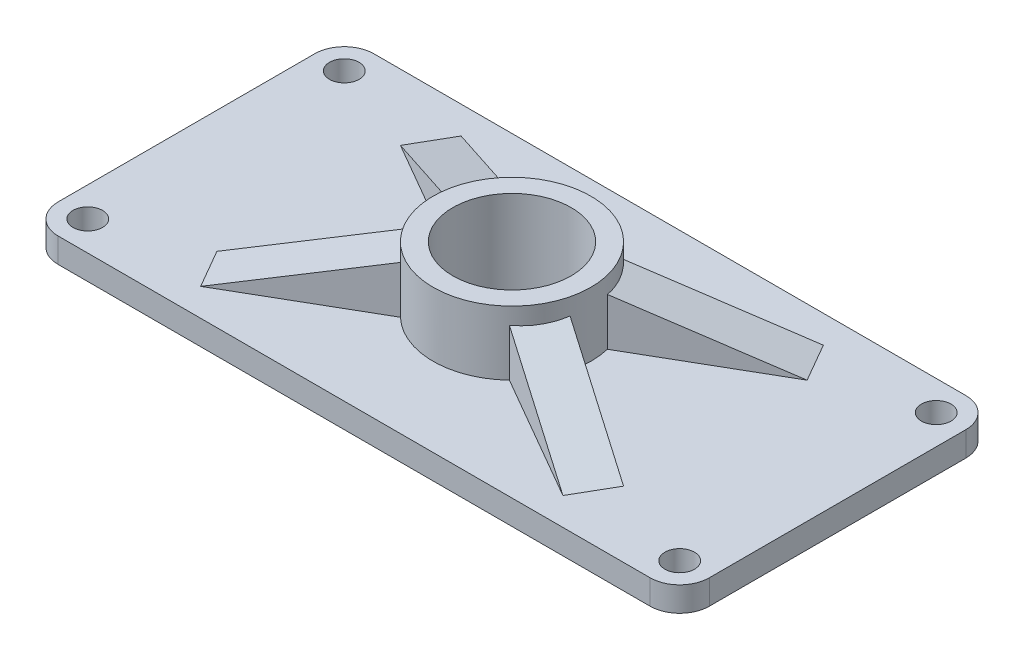
ISO-10303-21;
HEADER;
FILE_DESCRIPTION(('STEP AP214'),'2;1');
FILE_NAME('part.step','',(''),(''),'','','');
FILE_SCHEMA(('AUTOMOTIVE_DESIGN { 1 0 10303 214 1 1 1 1 }'));
ENDSEC;
DATA;
#1=APPLICATION_CONTEXT('core data for automotive mechanical design processes');
#2=APPLICATION_PROTOCOL_DEFINITION('international standard','automotive_design',2000,#1);
#3=PRODUCT_CONTEXT('',#1,'mechanical');
#4=PRODUCT('Part','Part','',(#3));
#5=PRODUCT_RELATED_PRODUCT_CATEGORY('part','',(#4));
#6=PRODUCT_DEFINITION_FORMATION('','',#4);
#7=PRODUCT_DEFINITION_CONTEXT('part definition',#1,'design');
#8=PRODUCT_DEFINITION('design','',#6,#7);
#9=PRODUCT_DEFINITION_SHAPE('','',#8);
#10=(LENGTH_UNIT() NAMED_UNIT(*) SI_UNIT(.MILLI.,.METRE.));
#11=(NAMED_UNIT(*) PLANE_ANGLE_UNIT() SI_UNIT($,.RADIAN.));
#12=(NAMED_UNIT(*) SI_UNIT($,.STERADIAN.) SOLID_ANGLE_UNIT());
#13=UNCERTAINTY_MEASURE_WITH_UNIT(LENGTH_MEASURE(1.E-05),#10,'distance_accuracy_value','');
#14=(GEOMETRIC_REPRESENTATION_CONTEXT(3) GLOBAL_UNCERTAINTY_ASSIGNED_CONTEXT((#13)) GLOBAL_UNIT_ASSIGNED_CONTEXT((#10,
#11,#12)) REPRESENTATION_CONTEXT('',''));
#15=CARTESIAN_POINT('',(0.,0.,0.));
#16=DIRECTION('',(0.,0.,1.));
#17=DIRECTION('',(1.,0.,0.));
#18=AXIS2_PLACEMENT_3D('',#15,#16,#17);
#19=CARTESIAN_POINT('',(-60.,5.,26.));
#20=DIRECTION('',(0.,-1.,0.));
#21=DIRECTION('',(0.,0.,-1.));
#22=AXIS2_PLACEMENT_3D('',#19,#20,#21);
#23=PLANE('',#22);
#24=CARTESIAN_POINT('',(-60.,5.,-26.));
#25=DIRECTION('',(0.,1.,0.));
#26=DIRECTION('',(0.,0.,1.));
#27=AXIS2_PLACEMENT_3D('',#24,#25,#26);
#28=CIRCLE('',#27,3.);
#29=CARTESIAN_POINT('',(-60.,5.,-23.));
#30=VERTEX_POINT('',#29);
#31=EDGE_CURVE('E309',#30,#30,#28,.T.);
#32=ORIENTED_EDGE('',*,*,#31,.F.);
#33=EDGE_LOOP('',(#32));
#34=FACE_BOUND('',#33,.T.);
#35=CARTESIAN_POINT('',(-60.,5.,-26.));
#36=DIRECTION('',(0.,1.,0.));
#37=DIRECTION('',(0.,0.,-1.));
#38=AXIS2_PLACEMENT_3D('',#35,#36,#37);
#39=CIRCLE('',#38,6.);
#40=CARTESIAN_POINT('',(-60.,5.,-32.));
#41=VERTEX_POINT('',#40);
#42=CARTESIAN_POINT('',(-66.,5.,-26.));
#43=VERTEX_POINT('',#42);
#44=EDGE_CURVE('E336',#41,#43,#39,.T.);
#45=ORIENTED_EDGE('',*,*,#44,.T.);
#46=DIRECTION('',(0.,0.,1.));
#47=VECTOR('',#46,1.);
#48=CARTESIAN_POINT('',(-66.,5.,26.));
#49=LINE('',#48,#47);
#50=CARTESIAN_POINT('',(-66.,5.,26.));
#51=VERTEX_POINT('',#50);
#52=EDGE_CURVE('E339',#43,#51,#49,.T.);
#53=ORIENTED_EDGE('',*,*,#52,.T.);
#54=CARTESIAN_POINT('',(-60.,5.,26.));
#55=DIRECTION('',(0.,1.,0.));
#56=DIRECTION('',(0.,0.,-1.));
#57=AXIS2_PLACEMENT_3D('',#54,#55,#56);
#58=CIRCLE('',#57,6.);
#59=CARTESIAN_POINT('',(-60.,5.,32.));
#60=VERTEX_POINT('',#59);
#61=EDGE_CURVE('E317',#51,#60,#58,.T.);
#62=ORIENTED_EDGE('',*,*,#61,.T.);
#63=DIRECTION('',(1.,0.,0.));
#64=VECTOR('',#63,1.);
#65=CARTESIAN_POINT('',(-60.,5.,32.));
#66=LINE('',#65,#64);
#67=CARTESIAN_POINT('',(60.,5.,32.));
#68=VERTEX_POINT('',#67);
#69=EDGE_CURVE('E320',#60,#68,#66,.T.);
#70=ORIENTED_EDGE('',*,*,#69,.T.);
#71=CARTESIAN_POINT('',(60.,5.,26.));
#72=DIRECTION('',(0.,1.,0.));
#73=DIRECTION('',(0.,0.,1.));
#74=AXIS2_PLACEMENT_3D('',#71,#72,#73);
#75=CIRCLE('',#74,6.);
#76=CARTESIAN_POINT('',(66.,5.,26.));
#77=VERTEX_POINT('',#76);
#78=EDGE_CURVE('E324',#68,#77,#75,.T.);
#79=ORIENTED_EDGE('',*,*,#78,.T.);
#80=DIRECTION('',(0.,0.,-1.));
#81=VECTOR('',#80,1.);
#82=CARTESIAN_POINT('',(66.,5.,26.));
#83=LINE('',#82,#81);
#84=CARTESIAN_POINT('',(66.,5.,-26.));
#85=VERTEX_POINT('',#84);
#86=EDGE_CURVE('E327',#77,#85,#83,.T.);
#87=ORIENTED_EDGE('',*,*,#86,.T.);
#88=CARTESIAN_POINT('',(60.,5.,-26.));
#89=DIRECTION('',(0.,1.,0.));
#90=DIRECTION('',(0.,0.,-1.));
#91=AXIS2_PLACEMENT_3D('',#88,#89,#90);
#92=CIRCLE('',#91,6.);
#93=CARTESIAN_POINT('',(60.,5.,-32.));
#94=VERTEX_POINT('',#93);
#95=EDGE_CURVE('E330',#85,#94,#92,.T.);
#96=ORIENTED_EDGE('',*,*,#95,.T.);
#97=DIRECTION('',(-1.,0.,0.));
#98=VECTOR('',#97,1.);
#99=CARTESIAN_POINT('',(-60.,5.,-32.));
#100=LINE('',#99,#98);
#101=EDGE_CURVE('E333',#94,#41,#100,.T.);
#102=ORIENTED_EDGE('',*,*,#101,.T.);
#103=EDGE_LOOP('',(#45,#53,#62,#70,#79,#87,#96,#102));
#104=FACE_BOUND('',#103,.T.);
#105=CARTESIAN_POINT('',(60.0000000000005,5.,26.));
#106=DIRECTION('',(0.,1.,0.));
#107=DIRECTION('',(0.,0.,1.));
#108=AXIS2_PLACEMENT_3D('',#105,#106,#107);
#109=CIRCLE('',#108,3.);
#110=CARTESIAN_POINT('',(60.0000000000005,5.,29.));
#111=VERTEX_POINT('',#110);
#112=EDGE_CURVE('E289',#111,#111,#109,.T.);
#113=ORIENTED_EDGE('',*,*,#112,.F.);
#114=EDGE_LOOP('',(#113));
#115=FACE_BOUND('',#114,.T.);
#116=CARTESIAN_POINT('',(60.,5.,-26.));
#117=DIRECTION('',(0.,1.,0.));
#118=DIRECTION('',(0.,0.,1.));
#119=AXIS2_PLACEMENT_3D('',#116,#117,#118);
#120=CIRCLE('',#119,3.);
#121=CARTESIAN_POINT('',(60.,5.,-23.));
#122=VERTEX_POINT('',#121);
#123=EDGE_CURVE('E297',#122,#122,#120,.T.);
#124=ORIENTED_EDGE('',*,*,#123,.F.);
#125=EDGE_LOOP('',(#124));
#126=FACE_BOUND('',#125,.T.);
#127=CARTESIAN_POINT('',(-59.9999999999995,5.,26.));
#128=DIRECTION('',(0.,1.,0.));
#129=DIRECTION('',(0.,0.,1.));
#130=AXIS2_PLACEMENT_3D('',#127,#128,#129);
#131=CIRCLE('',#130,3.);
#132=CARTESIAN_POINT('',(-59.9999999999995,5.,29.));
#133=VERTEX_POINT('',#132);
#134=EDGE_CURVE('E281',#133,#133,#131,.T.);
#135=ORIENTED_EDGE('',*,*,#134,.F.);
#136=EDGE_LOOP('',(#135));
#137=FACE_BOUND('',#136,.T.);
#138=DIRECTION('',(0.866025403784438,0.,0.500000000000001));
#139=VECTOR('',#138,1.);
#140=CARTESIAN_POINT('',(-35.9916697508022,5.,-15.5836477965032));
#141=LINE('',#140,#139);
#142=CARTESIAN_POINT('',(-41.2211431702997,5.,-18.6028856829701));
#143=VERTEX_POINT('',#142);
#144=CARTESIAN_POINT('',(-15.5470861469722,5.,-3.77996194936209));
#145=VERTEX_POINT('',#144);
#146=EDGE_CURVE('E216',#143,#145,#141,.T.);
#147=ORIENTED_EDGE('',*,*,#146,.F.);
#148=DIRECTION('',(0.500000000000001,0.,-0.866025403784438));
#149=VECTOR('',#148,1.);
#150=CARTESIAN_POINT('',(-65.2294734194975,5.,22.9807621135331));
#151=LINE('',#150,#149);
#152=CARTESIAN_POINT('',(-36.7211431702997,5.,-26.39711431703));
#153=VERTEX_POINT('',#152);
#154=EDGE_CURVE('E226',#143,#153,#151,.T.);
#155=ORIENTED_EDGE('',*,*,#154,.T.);
#156=DIRECTION('',(0.866025403784438,0.,0.500000000000001));
#157=VECTOR('',#156,1.);
#158=CARTESIAN_POINT('',(-31.4916697508022,5.,-23.3778764305631));
#159=LINE('',#158,#157);
#160=CARTESIAN_POINT('',(-11.0470861469722,5.,-11.574190583422));
#161=VERTEX_POINT('',#160);
#162=EDGE_CURVE('E223',#153,#161,#159,.T.);
#163=ORIENTED_EDGE('',*,*,#162,.T.);
#164=CARTESIAN_POINT('',(0.,5.,0.));
#165=DIRECTION('',(0.,-1.,0.));
#166=DIRECTION('',(0.,0.,-1.));
#167=AXIS2_PLACEMENT_3D('',#164,#165,#166);
#168=CIRCLE('',#167,16.);
#169=CARTESIAN_POINT('',(11.0470861469722,5.,-11.574190583422));
#170=VERTEX_POINT('',#169);
#171=EDGE_CURVE('E397',#170,#161,#168,.F.);
#172=ORIENTED_EDGE('',*,*,#171,.F.);
#173=DIRECTION('',(0.866025403784438,0.,-0.500000000000001));
#174=VECTOR('',#173,1.);
#175=CARTESIAN_POINT('',(-58.5083302491977,5.,28.5836477965033));
#176=LINE('',#175,#174);
#177=CARTESIAN_POINT('',(36.7211431702997,5.,-26.39711431703));
#178=VERTEX_POINT('',#177);
#179=EDGE_CURVE('E266',#170,#178,#176,.T.);
#180=ORIENTED_EDGE('',*,*,#179,.T.);
#181=DIRECTION('',(-0.500000000000001,0.,-0.866025403784438));
#182=VECTOR('',#181,1.);
#183=CARTESIAN_POINT('',(35.2294734194974,5.,-28.9807621135333));
#184=LINE('',#183,#182);
#185=CARTESIAN_POINT('',(41.2211431703,4.99999999999995,-18.6028856829702));
#186=VERTEX_POINT('',#185);
#187=EDGE_CURVE('E269',#178,#186,#184,.F.);
#188=ORIENTED_EDGE('',*,*,#187,.T.);
#189=DIRECTION('',(0.866025403784438,0.,-0.500000000000001));
#190=VECTOR('',#189,1.);
#191=CARTESIAN_POINT('',(-54.0083302491977,5.,36.3778764305632));
#192=LINE('',#191,#190);
#193=CARTESIAN_POINT('',(15.5470861469722,5.,-3.77996194936209));
#194=VERTEX_POINT('',#193);
#195=EDGE_CURVE('E259',#194,#186,#192,.T.);
#196=ORIENTED_EDGE('',*,*,#195,.F.);
#197=CARTESIAN_POINT('',(15.5470861469722,5.,3.77996194936209));
#198=VERTEX_POINT('',#197);
#199=EDGE_CURVE('E396',#198,#194,#168,.F.);
#200=ORIENTED_EDGE('',*,*,#199,.F.);
#201=DIRECTION('',(-0.866025403784438,0.,-0.500000000000001));
#202=VECTOR('',#201,1.);
#203=CARTESIAN_POINT('',(-31.4916697508022,5.,-23.3778764305631));
#204=LINE('',#203,#202);
#205=CARTESIAN_POINT('',(41.2211431702998,4.99999999999998,18.6028856829702));
#206=VERTEX_POINT('',#205);
#207=EDGE_CURVE('E64',#206,#198,#204,.T.);
#208=ORIENTED_EDGE('',*,*,#207,.F.);
#209=DIRECTION('',(-0.500000000000001,0.,0.866025403784438));
#210=VECTOR('',#209,1.);
#211=CARTESIAN_POINT('',(12.7128129211019,5.,67.9807621135332));
#212=LINE('',#211,#210);
#213=CARTESIAN_POINT('',(36.7211431702997,5.,26.39711431703));
#214=VERTEX_POINT('',#213);
#215=EDGE_CURVE('E59',#206,#214,#212,.T.);
#216=ORIENTED_EDGE('',*,*,#215,.T.);
#217=DIRECTION('',(-0.866025403784438,0.,-0.500000000000001));
#218=VECTOR('',#217,1.);
#219=CARTESIAN_POINT('',(-35.9916697508022,5.,-15.5836477965032));
#220=LINE('',#219,#218);
#221=CARTESIAN_POINT('',(11.0470861469722,5.,11.574190583422));
#222=VERTEX_POINT('',#221);
#223=EDGE_CURVE('E194',#214,#222,#220,.T.);
#224=ORIENTED_EDGE('',*,*,#223,.T.);
#225=CARTESIAN_POINT('',(-11.0470861469722,5.,11.574190583422));
#226=VERTEX_POINT('',#225);
#227=EDGE_CURVE('E403',#226,#222,#168,.F.);
#228=ORIENTED_EDGE('',*,*,#227,.F.);
#229=DIRECTION('',(-0.866025403784438,0.,0.500000000000001));
#230=VECTOR('',#229,1.);
#231=CARTESIAN_POINT('',(-54.0083302491977,5.,36.3778764305632));
#232=LINE('',#231,#230);
#233=CARTESIAN_POINT('',(-36.7211431702997,5.,26.39711431703));
#234=VERTEX_POINT('',#233);
#235=EDGE_CURVE('E238',#226,#234,#232,.T.);
#236=ORIENTED_EDGE('',*,*,#235,.T.);
#237=DIRECTION('',(0.500000000000001,0.,0.866025403784438));
#238=VECTOR('',#237,1.);
#239=CARTESIAN_POINT('',(-42.7128129211021,5.,16.0192378864668));
#240=LINE('',#239,#238);
#241=CARTESIAN_POINT('',(-41.2211431702997,5.00000000000001,18.6028856829701));
#242=VERTEX_POINT('',#241);
#243=EDGE_CURVE('E248',#234,#242,#240,.F.);
#244=ORIENTED_EDGE('',*,*,#243,.T.);
#245=DIRECTION('',(-0.866025403784438,0.,0.500000000000001));
#246=VECTOR('',#245,1.);
#247=CARTESIAN_POINT('',(-58.5083302491977,5.,28.5836477965033));
#248=LINE('',#247,#246);
#249=CARTESIAN_POINT('',(-15.5470861469722,5.,3.77996194936209));
#250=VERTEX_POINT('',#249);
#251=EDGE_CURVE('E244',#250,#242,#248,.T.);
#252=ORIENTED_EDGE('',*,*,#251,.F.);
#253=EDGE_CURVE('E402',#145,#250,#168,.F.);
#254=ORIENTED_EDGE('',*,*,#253,.F.);
#255=EDGE_LOOP('',(#147,#155,#163,#172,#180,#188,#196,#200,#208,#216,#224,#228,#236,#244,#252,#254));
#256=FACE_BOUND('',#255,.T.);
#257=ADVANCED_FACE('F43',(#34,#104,#115,#126,#137,#256),#23,.F.);
#258=CARTESIAN_POINT('',(-60.,0.,26.));
#259=DIRECTION('',(0.,-1.,0.));
#260=DIRECTION('',(0.,0.,-1.));
#261=AXIS2_PLACEMENT_3D('',#258,#259,#260);
#262=PLANE('',#261);
#263=CARTESIAN_POINT('',(60.,0.,26.));
#264=DIRECTION('',(0.,1.,0.));
#265=DIRECTION('',(0.,0.,1.));
#266=AXIS2_PLACEMENT_3D('',#263,#264,#265);
#267=CIRCLE('',#266,6.);
#268=CARTESIAN_POINT('',(60.,0.,32.));
#269=VERTEX_POINT('',#268);
#270=CARTESIAN_POINT('',(66.,0.,26.));
#271=VERTEX_POINT('',#270);
#272=EDGE_CURVE('E348',#269,#271,#267,.T.);
#273=ORIENTED_EDGE('',*,*,#272,.F.);
#274=DIRECTION('',(1.,0.,0.));
#275=VECTOR('',#274,1.);
#276=CARTESIAN_POINT('',(-60.,0.,32.));
#277=LINE('',#276,#275);
#278=CARTESIAN_POINT('',(-60.,0.,32.));
#279=VERTEX_POINT('',#278);
#280=EDGE_CURVE('E345',#279,#269,#277,.T.);
#281=ORIENTED_EDGE('',*,*,#280,.F.);
#282=CARTESIAN_POINT('',(-60.,0.,26.));
#283=DIRECTION('',(0.,1.,0.));
#284=DIRECTION('',(0.,0.,-1.));
#285=AXIS2_PLACEMENT_3D('',#282,#283,#284);
#286=CIRCLE('',#285,6.);
#287=CARTESIAN_POINT('',(-66.,0.,26.));
#288=VERTEX_POINT('',#287);
#289=EDGE_CURVE('E313',#288,#279,#286,.T.);
#290=ORIENTED_EDGE('',*,*,#289,.F.);
#291=DIRECTION('',(0.,0.,1.));
#292=VECTOR('',#291,1.);
#293=CARTESIAN_POINT('',(-66.,0.,26.));
#294=LINE('',#293,#292);
#295=CARTESIAN_POINT('',(-66.,0.,-26.));
#296=VERTEX_POINT('',#295);
#297=EDGE_CURVE('E321',#296,#288,#294,.T.);
#298=ORIENTED_EDGE('',*,*,#297,.F.);
#299=CARTESIAN_POINT('',(-60.,0.,-26.));
#300=DIRECTION('',(0.,1.,0.));
#301=DIRECTION('',(0.,0.,-1.));
#302=AXIS2_PLACEMENT_3D('',#299,#300,#301);
#303=CIRCLE('',#302,6.);
#304=CARTESIAN_POINT('',(-60.,0.,-32.));
#305=VERTEX_POINT('',#304);
#306=EDGE_CURVE('E360',#305,#296,#303,.T.);
#307=ORIENTED_EDGE('',*,*,#306,.F.);
#308=DIRECTION('',(-1.,0.,0.));
#309=VECTOR('',#308,1.);
#310=CARTESIAN_POINT('',(-60.,0.,-32.));
#311=LINE('',#310,#309);
#312=CARTESIAN_POINT('',(60.,0.,-32.));
#313=VERTEX_POINT('',#312);
#314=EDGE_CURVE('E357',#313,#305,#311,.T.);
#315=ORIENTED_EDGE('',*,*,#314,.F.);
#316=CARTESIAN_POINT('',(60.,0.,-26.));
#317=DIRECTION('',(0.,1.,0.));
#318=DIRECTION('',(0.,0.,-1.));
#319=AXIS2_PLACEMENT_3D('',#316,#317,#318);
#320=CIRCLE('',#319,6.);
#321=CARTESIAN_POINT('',(66.,0.,-26.));
#322=VERTEX_POINT('',#321);
#323=EDGE_CURVE('E354',#322,#313,#320,.T.);
#324=ORIENTED_EDGE('',*,*,#323,.F.);
#325=DIRECTION('',(0.,0.,-1.));
#326=VECTOR('',#325,1.);
#327=CARTESIAN_POINT('',(66.,0.,26.));
#328=LINE('',#327,#326);
#329=EDGE_CURVE('E351',#271,#322,#328,.T.);
#330=ORIENTED_EDGE('',*,*,#329,.F.);
#331=EDGE_LOOP('',(#273,#281,#290,#298,#307,#315,#324,#330));
#332=FACE_BOUND('',#331,.T.);
#333=CARTESIAN_POINT('',(0.,0.,0.));
#334=DIRECTION('',(0.,1.,0.));
#335=DIRECTION('',(0.,0.,1.));
#336=AXIS2_PLACEMENT_3D('',#333,#334,#335);
#337=CIRCLE('',#336,12.);
#338=CARTESIAN_POINT('',(0.,0.,12.));
#339=VERTEX_POINT('',#338);
#340=EDGE_CURVE('E301',#339,#339,#337,.T.);
#341=ORIENTED_EDGE('',*,*,#340,.T.);
#342=EDGE_LOOP('',(#341));
#343=FACE_BOUND('',#342,.T.);
#344=CARTESIAN_POINT('',(-60.,0.,-26.));
#345=DIRECTION('',(0.,1.,0.));
#346=DIRECTION('',(0.,0.,1.));
#347=AXIS2_PLACEMENT_3D('',#344,#345,#346);
#348=CIRCLE('',#347,3.);
#349=CARTESIAN_POINT('',(-60.,0.,-23.));
#350=VERTEX_POINT('',#349);
#351=EDGE_CURVE('E308',#350,#350,#348,.T.);
#352=ORIENTED_EDGE('',*,*,#351,.T.);
#353=EDGE_LOOP('',(#352));
#354=FACE_BOUND('',#353,.T.);
#355=CARTESIAN_POINT('',(60.0000000000005,0.,26.));
#356=DIRECTION('',(0.,1.,0.));
#357=DIRECTION('',(0.,0.,1.));
#358=AXIS2_PLACEMENT_3D('',#355,#356,#357);
#359=CIRCLE('',#358,3.);
#360=CARTESIAN_POINT('',(60.0000000000005,0.,29.));
#361=VERTEX_POINT('',#360);
#362=EDGE_CURVE('E285',#361,#361,#359,.T.);
#363=ORIENTED_EDGE('',*,*,#362,.T.);
#364=EDGE_LOOP('',(#363));
#365=FACE_BOUND('',#364,.T.);
#366=CARTESIAN_POINT('',(60.,0.,-26.));
#367=DIRECTION('',(0.,1.,0.));
#368=DIRECTION('',(0.,0.,1.));
#369=AXIS2_PLACEMENT_3D('',#366,#367,#368);
#370=CIRCLE('',#369,3.);
#371=CARTESIAN_POINT('',(60.,0.,-23.));
#372=VERTEX_POINT('',#371);
#373=EDGE_CURVE('E293',#372,#372,#370,.T.);
#374=ORIENTED_EDGE('',*,*,#373,.T.);
#375=EDGE_LOOP('',(#374));
#376=FACE_BOUND('',#375,.T.);
#377=CARTESIAN_POINT('',(-59.9999999999995,0.,26.));
#378=DIRECTION('',(0.,1.,0.));
#379=DIRECTION('',(0.,0.,1.));
#380=AXIS2_PLACEMENT_3D('',#377,#378,#379);
#381=CIRCLE('',#380,3.);
#382=CARTESIAN_POINT('',(-59.9999999999995,0.,29.));
#383=VERTEX_POINT('',#382);
#384=EDGE_CURVE('E280',#383,#383,#381,.T.);
#385=ORIENTED_EDGE('',*,*,#384,.T.);
#386=EDGE_LOOP('',(#385));
#387=FACE_BOUND('',#386,.T.);
#388=ADVANCED_FACE('F465',(#332,#343,#354,#365,#376,#387),#262,.T.);
#389=CARTESIAN_POINT('',(-60.,5.,26.));
#390=DIRECTION('',(0.,-1.,0.));
#391=DIRECTION('',(0.,0.,-1.));
#392=AXIS2_PLACEMENT_3D('',#389,#390,#391);
#393=CYLINDRICAL_SURFACE('',#392,6.);
#394=ORIENTED_EDGE('',*,*,#289,.T.);
#395=DIRECTION('',(0.,-1.,0.));
#396=VECTOR('',#395,1.);
#397=CARTESIAN_POINT('',(-60.,5.,32.));
#398=LINE('',#397,#396);
#399=EDGE_CURVE('E392',#60,#279,#398,.T.);
#400=ORIENTED_EDGE('',*,*,#399,.F.);
#401=ORIENTED_EDGE('',*,*,#61,.F.);
#402=DIRECTION('',(0.,-1.,0.));
#403=VECTOR('',#402,1.);
#404=CARTESIAN_POINT('',(-66.,5.,26.));
#405=LINE('',#404,#403);
#406=EDGE_CURVE('E342',#51,#288,#405,.T.);
#407=ORIENTED_EDGE('',*,*,#406,.T.);
#408=EDGE_LOOP('',(#394,#400,#401,#407));
#409=FACE_BOUND('',#408,.T.);
#410=ADVANCED_FACE('F45',(#409),#393,.T.);
#411=CARTESIAN_POINT('',(-60.,5.,32.));
#412=DIRECTION('',(0.,0.,-1.));
#413=DIRECTION('',(-1.,0.,0.));
#414=AXIS2_PLACEMENT_3D('',#411,#412,#413);
#415=PLANE('',#414);
#416=ORIENTED_EDGE('',*,*,#280,.T.);
#417=DIRECTION('',(0.,-1.,0.));
#418=VECTOR('',#417,1.);
#419=CARTESIAN_POINT('',(60.,5.,32.));
#420=LINE('',#419,#418);
#421=EDGE_CURVE('E388',#68,#269,#420,.T.);
#422=ORIENTED_EDGE('',*,*,#421,.F.);
#423=ORIENTED_EDGE('',*,*,#69,.F.);
#424=ORIENTED_EDGE('',*,*,#399,.T.);
#425=EDGE_LOOP('',(#416,#422,#423,#424));
#426=FACE_BOUND('',#425,.T.);
#427=ADVANCED_FACE('F501',(#426),#415,.F.);
#428=CARTESIAN_POINT('',(60.,5.,26.));
#429=DIRECTION('',(0.,-1.,0.));
#430=DIRECTION('',(0.,0.,-1.));
#431=AXIS2_PLACEMENT_3D('',#428,#429,#430);
#432=CYLINDRICAL_SURFACE('',#431,6.);
#433=DIRECTION('',(0.,-1.,0.));
#434=VECTOR('',#433,1.);
#435=CARTESIAN_POINT('',(66.,5.,26.));
#436=LINE('',#435,#434);
#437=EDGE_CURVE('E384',#77,#271,#436,.T.);
#438=ORIENTED_EDGE('',*,*,#437,.F.);
#439=ORIENTED_EDGE('',*,*,#78,.F.);
#440=ORIENTED_EDGE('',*,*,#421,.T.);
#441=ORIENTED_EDGE('',*,*,#272,.T.);
#442=EDGE_LOOP('',(#438,#439,#440,#441));
#443=FACE_BOUND('',#442,.T.);
#444=ADVANCED_FACE('F498',(#443),#432,.T.);
#445=CARTESIAN_POINT('',(66.,5.,26.));
#446=DIRECTION('',(-1.,0.,0.));
#447=DIRECTION('',(0.,0.,1.));
#448=AXIS2_PLACEMENT_3D('',#445,#446,#447);
#449=PLANE('',#448);
#450=ORIENTED_EDGE('',*,*,#329,.T.);
#451=DIRECTION('',(0.,-1.,0.));
#452=VECTOR('',#451,1.);
#453=CARTESIAN_POINT('',(66.,5.,-26.));
#454=LINE('',#453,#452);
#455=EDGE_CURVE('E380',#85,#322,#454,.T.);
#456=ORIENTED_EDGE('',*,*,#455,.F.);
#457=ORIENTED_EDGE('',*,*,#86,.F.);
#458=ORIENTED_EDGE('',*,*,#437,.T.);
#459=EDGE_LOOP('',(#450,#456,#457,#458));
#460=FACE_BOUND('',#459,.T.);
#461=ADVANCED_FACE('F494',(#460),#449,.F.);
#462=CARTESIAN_POINT('',(60.,5.,-26.));
#463=DIRECTION('',(0.,-1.,0.));
#464=DIRECTION('',(0.,0.,-1.));
#465=AXIS2_PLACEMENT_3D('',#462,#463,#464);
#466=CYLINDRICAL_SURFACE('',#465,6.);
#467=ORIENTED_EDGE('',*,*,#323,.T.);
#468=DIRECTION('',(0.,-1.,0.));
#469=VECTOR('',#468,1.);
#470=CARTESIAN_POINT('',(60.,5.,-32.));
#471=LINE('',#470,#469);
#472=EDGE_CURVE('E376',#94,#313,#471,.T.);
#473=ORIENTED_EDGE('',*,*,#472,.F.);
#474=ORIENTED_EDGE('',*,*,#95,.F.);
#475=ORIENTED_EDGE('',*,*,#455,.T.);
#476=EDGE_LOOP('',(#467,#473,#474,#475));
#477=FACE_BOUND('',#476,.T.);
#478=ADVANCED_FACE('F490',(#477),#466,.T.);
#479=CARTESIAN_POINT('',(-60.,5.,-32.));
#480=DIRECTION('',(0.,0.,1.));
#481=DIRECTION('',(1.,0.,0.));
#482=AXIS2_PLACEMENT_3D('',#479,#480,#481);
#483=PLANE('',#482);
#484=DIRECTION('',(0.,-1.,0.));
#485=VECTOR('',#484,1.);
#486=CARTESIAN_POINT('',(-60.,5.,-32.));
#487=LINE('',#486,#485);
#488=EDGE_CURVE('E372',#41,#305,#487,.T.);
#489=ORIENTED_EDGE('',*,*,#488,.F.);
#490=ORIENTED_EDGE('',*,*,#101,.F.);
#491=ORIENTED_EDGE('',*,*,#472,.T.);
#492=ORIENTED_EDGE('',*,*,#314,.T.);
#493=EDGE_LOOP('',(#489,#490,#491,#492));
#494=FACE_BOUND('',#493,.T.);
#495=ADVANCED_FACE('F486',(#494),#483,.F.);
#496=CARTESIAN_POINT('',(-60.,5.,-26.));
#497=DIRECTION('',(0.,-1.,0.));
#498=DIRECTION('',(0.,0.,-1.));
#499=AXIS2_PLACEMENT_3D('',#496,#497,#498);
#500=CYLINDRICAL_SURFACE('',#499,6.);
#501=DIRECTION('',(0.,-1.,0.));
#502=VECTOR('',#501,1.);
#503=CARTESIAN_POINT('',(-66.,5.,-26.));
#504=LINE('',#503,#502);
#505=EDGE_CURVE('E368',#43,#296,#504,.T.);
#506=ORIENTED_EDGE('',*,*,#505,.F.);
#507=ORIENTED_EDGE('',*,*,#44,.F.);
#508=ORIENTED_EDGE('',*,*,#488,.T.);
#509=ORIENTED_EDGE('',*,*,#306,.T.);
#510=EDGE_LOOP('',(#506,#507,#508,#509));
#511=FACE_BOUND('',#510,.T.);
#512=ADVANCED_FACE('F482',(#511),#500,.T.);
#513=CARTESIAN_POINT('',(-66.,5.,26.));
#514=DIRECTION('',(1.,0.,0.));
#515=DIRECTION('',(0.,0.,-1.));
#516=AXIS2_PLACEMENT_3D('',#513,#514,#515);
#517=PLANE('',#516);
#518=ORIENTED_EDGE('',*,*,#297,.T.);
#519=ORIENTED_EDGE('',*,*,#406,.F.);
#520=ORIENTED_EDGE('',*,*,#52,.F.);
#521=ORIENTED_EDGE('',*,*,#505,.T.);
#522=EDGE_LOOP('',(#518,#519,#520,#521));
#523=FACE_BOUND('',#522,.T.);
#524=ADVANCED_FACE('F479',(#523),#517,.F.);
#525=CARTESIAN_POINT('',(-60.,5.,-26.));
#526=DIRECTION('',(0.,-1.,0.));
#527=DIRECTION('',(0.,0.,-1.));
#528=AXIS2_PLACEMENT_3D('',#525,#526,#527);
#529=CYLINDRICAL_SURFACE('',#528,3.);
#530=ORIENTED_EDGE('',*,*,#351,.F.);
#531=EDGE_LOOP('',(#530));
#532=FACE_BOUND('',#531,.T.);
#533=ORIENTED_EDGE('',*,*,#31,.T.);
#534=EDGE_LOOP('',(#533));
#535=FACE_BOUND('',#534,.T.);
#536=ADVANCED_FACE('F476',(#532,#535),#529,.F.);
#537=CARTESIAN_POINT('',(0.,5.,0.));
#538=DIRECTION('',(0.,-1.,0.));
#539=DIRECTION('',(0.,0.,-1.));
#540=AXIS2_PLACEMENT_3D('',#537,#538,#539);
#541=CYLINDRICAL_SURFACE('',#540,12.);
#542=ORIENTED_EDGE('',*,*,#340,.F.);
#543=EDGE_LOOP('',(#542));
#544=FACE_BOUND('',#543,.T.);
#545=CARTESIAN_POINT('',(0.,18.,0.));
#546=DIRECTION('',(0.,1.,0.));
#547=DIRECTION('',(0.,0.,1.));
#548=AXIS2_PLACEMENT_3D('',#545,#546,#547);
#549=CIRCLE('',#548,12.);
#550=CARTESIAN_POINT('',(0.,18.,12.));
#551=VERTEX_POINT('',#550);
#552=EDGE_CURVE('E272',#551,#551,#549,.T.);
#553=ORIENTED_EDGE('',*,*,#552,.T.);
#554=EDGE_LOOP('',(#553));
#555=FACE_BOUND('',#554,.T.);
#556=ADVANCED_FACE('F560',(#544,#555),#541,.F.);
#557=CARTESIAN_POINT('',(60.,5.,-26.));
#558=DIRECTION('',(0.,-1.,0.));
#559=DIRECTION('',(0.,0.,-1.));
#560=AXIS2_PLACEMENT_3D('',#557,#558,#559);
#561=CYLINDRICAL_SURFACE('',#560,3.);
#562=ORIENTED_EDGE('',*,*,#373,.F.);
#563=EDGE_LOOP('',(#562));
#564=FACE_BOUND('',#563,.T.);
#565=ORIENTED_EDGE('',*,*,#123,.T.);
#566=EDGE_LOOP('',(#565));
#567=FACE_BOUND('',#566,.T.);
#568=ADVANCED_FACE('F553',(#564,#567),#561,.F.);
#569=CARTESIAN_POINT('',(60.0000000000005,5.,26.));
#570=DIRECTION('',(0.,-1.,0.));
#571=DIRECTION('',(0.,0.,-1.));
#572=AXIS2_PLACEMENT_3D('',#569,#570,#571);
#573=CYLINDRICAL_SURFACE('',#572,3.);
#574=ORIENTED_EDGE('',*,*,#362,.F.);
#575=EDGE_LOOP('',(#574));
#576=FACE_BOUND('',#575,.T.);
#577=ORIENTED_EDGE('',*,*,#112,.T.);
#578=EDGE_LOOP('',(#577));
#579=FACE_BOUND('',#578,.T.);
#580=ADVANCED_FACE('F544',(#576,#579),#573,.F.);
#581=CARTESIAN_POINT('',(-59.9999999999995,5.,26.));
#582=DIRECTION('',(0.,-1.,0.));
#583=DIRECTION('',(0.,0.,-1.));
#584=AXIS2_PLACEMENT_3D('',#581,#582,#583);
#585=CYLINDRICAL_SURFACE('',#584,3.);
#586=ORIENTED_EDGE('',*,*,#384,.F.);
#587=EDGE_LOOP('',(#586));
#588=FACE_BOUND('',#587,.T.);
#589=ORIENTED_EDGE('',*,*,#134,.T.);
#590=EDGE_LOOP('',(#589));
#591=FACE_BOUND('',#590,.T.);
#592=ADVANCED_FACE('F541',(#588,#591),#585,.F.);
#593=CARTESIAN_POINT('',(0.,18.,0.));
#594=DIRECTION('',(0.,1.,0.));
#595=DIRECTION('',(0.,0.,1.));
#596=AXIS2_PLACEMENT_3D('',#593,#594,#595);
#597=PLANE('',#596);
#598=ORIENTED_EDGE('',*,*,#552,.F.);
#599=EDGE_LOOP('',(#598));
#600=FACE_BOUND('',#599,.T.);
#601=CARTESIAN_POINT('',(0.,18.,0.));
#602=DIRECTION('',(0.,1.,0.));
#603=DIRECTION('',(0.,0.,1.));
#604=AXIS2_PLACEMENT_3D('',#601,#602,#603);
#605=CIRCLE('',#604,16.);
#606=CARTESIAN_POINT('',(0.,18.,16.));
#607=VERTEX_POINT('',#606);
#608=EDGE_CURVE('E276',#607,#607,#605,.T.);
#609=ORIENTED_EDGE('',*,*,#608,.T.);
#610=EDGE_LOOP('',(#609));
#611=FACE_BOUND('',#610,.T.);
#612=ADVANCED_FACE('F543',(#600,#611),#597,.T.);
#613=CARTESIAN_POINT('',(0.,18.,0.));
#614=DIRECTION('',(0.,-1.,0.));
#615=DIRECTION('',(0.,0.,-1.));
#616=AXIS2_PLACEMENT_3D('',#613,#614,#615);
#617=CYLINDRICAL_SURFACE('',#616,16.);
#618=CARTESIAN_POINT('',(0.,19.6213863304805,0.));
#619=DIRECTION('',(-0.267616567329812,0.951056516295155,-0.154508497187471));
#620=DIRECTION('',(-0.823639103546333,-0.309016994374942,-0.475528258147579));
#621=AXIS2_PLACEMENT_3D('',#618,#619,#620);
#622=ELLIPSE('',#621,16.8233955878122,16.);
#623=CARTESIAN_POINT('',(-11.0470861469722,14.6325197536147,-11.574190583422));
#624=VERTEX_POINT('',#623);
#625=CARTESIAN_POINT('',(-15.5470861469722,14.6325197536147,-3.77996194936209));
#626=VERTEX_POINT('',#625);
#627=EDGE_CURVE('E421',#624,#626,#622,.T.);
#628=ORIENTED_EDGE('',*,*,#627,.T.);
#629=DIRECTION('',(0.,-1.,0.));
#630=VECTOR('',#629,1.);
#631=CARTESIAN_POINT('',(-15.5470861469722,18.,-3.77996194936209));
#632=LINE('',#631,#630);
#633=EDGE_CURVE('E417',#145,#626,#632,.F.);
#634=ORIENTED_EDGE('',*,*,#633,.F.);
#635=ORIENTED_EDGE('',*,*,#253,.T.);
#636=DIRECTION('',(0.,-1.,0.));
#637=VECTOR('',#636,1.);
#638=CARTESIAN_POINT('',(-15.5470861469722,18.,3.77996194936209));
#639=LINE('',#638,#637);
#640=CARTESIAN_POINT('',(-15.5470861469722,14.6325197536147,3.77996194936209));
#641=VERTEX_POINT('',#640);
#642=EDGE_CURVE('E241',#641,#250,#639,.T.);
#643=ORIENTED_EDGE('',*,*,#642,.F.);
#644=CARTESIAN_POINT('',(0.,19.6213863304805,0.));
#645=DIRECTION('',(0.267616567329812,-0.951056516295155,-0.154508497187471));
#646=DIRECTION('',(-0.823639103546333,-0.309016994374942,0.475528258147579));
#647=AXIS2_PLACEMENT_3D('',#644,#645,#646);
#648=ELLIPSE('',#647,16.8233955878122,16.);
#649=CARTESIAN_POINT('',(-11.0470861469722,14.6325197536147,11.574190583422));
#650=VERTEX_POINT('',#649);
#651=EDGE_CURVE('E414',#641,#650,#648,.F.);
#652=ORIENTED_EDGE('',*,*,#651,.T.);
#653=DIRECTION('',(0.,-1.,0.));
#654=VECTOR('',#653,1.);
#655=CARTESIAN_POINT('',(-11.0470861469722,18.,11.574190583422));
#656=LINE('',#655,#654);
#657=EDGE_CURVE('E234',#650,#226,#656,.T.);
#658=ORIENTED_EDGE('',*,*,#657,.T.);
#659=ORIENTED_EDGE('',*,*,#227,.T.);
#660=DIRECTION('',(0.,-1.,0.));
#661=VECTOR('',#660,1.);
#662=CARTESIAN_POINT('',(11.0470861469722,18.,11.574190583422));
#663=LINE('',#662,#661);
#664=CARTESIAN_POINT('',(11.0470861469722,14.6325197536147,11.574190583422));
#665=VERTEX_POINT('',#664);
#666=EDGE_CURVE('E184',#222,#665,#663,.F.);
#667=ORIENTED_EDGE('',*,*,#666,.T.);
#668=CARTESIAN_POINT('',(0.,19.6213863304805,0.));
#669=DIRECTION('',(0.267616567329812,0.951056516295155,0.154508497187471));
#670=DIRECTION('',(0.823639103546333,-0.309016994374942,0.475528258147579));
#671=AXIS2_PLACEMENT_3D('',#668,#669,#670);
#672=ELLIPSE('',#671,16.8233955878122,16.);
#673=CARTESIAN_POINT('',(15.5470861469722,14.6325197536147,3.77996194936209));
#674=VERTEX_POINT('',#673);
#675=EDGE_CURVE('E11',#665,#674,#672,.T.);
#676=ORIENTED_EDGE('',*,*,#675,.T.);
#677=DIRECTION('',(0.,-1.,0.));
#678=VECTOR('',#677,1.);
#679=CARTESIAN_POINT('',(15.5470861469722,18.,3.77996194936209));
#680=LINE('',#679,#678);
#681=EDGE_CURVE('E181',#198,#674,#680,.F.);
#682=ORIENTED_EDGE('',*,*,#681,.F.);
#683=ORIENTED_EDGE('',*,*,#199,.T.);
#684=DIRECTION('',(0.,-1.,0.));
#685=VECTOR('',#684,1.);
#686=CARTESIAN_POINT('',(15.5470861469722,18.,-3.77996194936209));
#687=LINE('',#686,#685);
#688=CARTESIAN_POINT('',(15.5470861469722,14.6325197536147,-3.77996194936209));
#689=VERTEX_POINT('',#688);
#690=EDGE_CURVE('E401',#689,#194,#687,.T.);
#691=ORIENTED_EDGE('',*,*,#690,.F.);
#692=CARTESIAN_POINT('',(0.,19.6213863304805,0.));
#693=DIRECTION('',(-0.267616567329812,-0.951056516295155,0.154508497187471));
#694=DIRECTION('',(0.823639103546333,-0.309016994374942,-0.475528258147579));
#695=AXIS2_PLACEMENT_3D('',#692,#693,#694);
#696=ELLIPSE('',#695,16.8233955878122,16.);
#697=CARTESIAN_POINT('',(11.0470861469722,14.6325197536147,-11.574190583422));
#698=VERTEX_POINT('',#697);
#699=EDGE_CURVE('E407',#689,#698,#696,.F.);
#700=ORIENTED_EDGE('',*,*,#699,.T.);
#701=DIRECTION('',(0.,-1.,0.));
#702=VECTOR('',#701,1.);
#703=CARTESIAN_POINT('',(11.0470861469722,18.,-11.574190583422));
#704=LINE('',#703,#702);
#705=EDGE_CURVE('E410',#698,#170,#704,.T.);
#706=ORIENTED_EDGE('',*,*,#705,.T.);
#707=ORIENTED_EDGE('',*,*,#171,.T.);
#708=DIRECTION('',(0.,-1.,0.));
#709=VECTOR('',#708,1.);
#710=CARTESIAN_POINT('',(-11.0470861469722,18.,-11.574190583422));
#711=LINE('',#710,#709);
#712=EDGE_CURVE('E52',#161,#624,#711,.F.);
#713=ORIENTED_EDGE('',*,*,#712,.T.);
#714=EDGE_LOOP('',(#628,#634,#635,#643,#652,#658,#659,#667,#676,#682,#683,#691,#700,#706,#707,#713));
#715=FACE_BOUND('',#714,.T.);
#716=ORIENTED_EDGE('',*,*,#608,.F.);
#717=EDGE_LOOP('',(#716));
#718=FACE_BOUND('',#717,.T.);
#719=ADVANCED_FACE('F179',(#715,#718),#617,.T.);
#720=CARTESIAN_POINT('',(38.9711431702997,5.,-22.5000000000001));
#721=DIRECTION('',(-0.267616567329812,-0.951056516295155,0.154508497187471));
#722=DIRECTION('',(-0.823639103546333,0.309016994374942,0.475528258147579));
#723=AXIS2_PLACEMENT_3D('',#720,#721,#722);
#724=PLANE('',#723);
#725=ORIENTED_EDGE('',*,*,#187,.F.);
#726=DIRECTION('',(-0.823639103546333,0.309016994374942,0.475528258147579));
#727=VECTOR('',#726,1.);
#728=CARTESIAN_POINT('',(36.7211431702997,5.,-26.39711431703));
#729=LINE('',#728,#727);
#730=EDGE_CURVE('E255',#178,#698,#729,.T.);
#731=ORIENTED_EDGE('',*,*,#730,.T.);
#732=ORIENTED_EDGE('',*,*,#699,.F.);
#733=DIRECTION('',(-0.823639103546333,0.309016994374942,0.475528258147579));
#734=VECTOR('',#733,1.);
#735=CARTESIAN_POINT('',(41.2211431702997,5.,-18.6028856829701));
#736=LINE('',#735,#734);
#737=EDGE_CURVE('E254',#186,#689,#736,.T.);
#738=ORIENTED_EDGE('',*,*,#737,.F.);
#739=EDGE_LOOP('',(#725,#731,#732,#738));
#740=FACE_BOUND('',#739,.T.);
#741=ADVANCED_FACE('F448',(#740),#724,.F.);
#742=CARTESIAN_POINT('',(-2.25000000000002,9.,-3.89711431702997));
#743=DIRECTION('',(-0.500000000000001,0.,-0.866025403784438));
#744=DIRECTION('',(-0.866025403784438,0.,0.500000000000001));
#745=AXIS2_PLACEMENT_3D('',#742,#743,#744);
#746=PLANE('',#745);
#747=ORIENTED_EDGE('',*,*,#730,.F.);
#748=ORIENTED_EDGE('',*,*,#179,.F.);
#749=ORIENTED_EDGE('',*,*,#705,.F.);
#750=EDGE_LOOP('',(#747,#748,#749));
#751=FACE_BOUND('',#750,.T.);
#752=ADVANCED_FACE('F453',(#751),#746,.T.);
#753=CARTESIAN_POINT('',(2.25,9.,3.89711431702998));
#754=DIRECTION('',(-0.500000000000001,0.,-0.866025403784438));
#755=DIRECTION('',(-0.866025403784438,0.,0.500000000000001));
#756=AXIS2_PLACEMENT_3D('',#753,#754,#755);
#757=PLANE('',#756);
#758=ORIENTED_EDGE('',*,*,#690,.T.);
#759=ORIENTED_EDGE('',*,*,#195,.T.);
#760=ORIENTED_EDGE('',*,*,#737,.T.);
#761=EDGE_LOOP('',(#758,#759,#760));
#762=FACE_BOUND('',#761,.T.);
#763=ADVANCED_FACE('F446',(#762),#757,.F.);
#764=CARTESIAN_POINT('',(-38.9711431702997,5.,22.5000000000001));
#765=DIRECTION('',(0.267616567329812,-0.951056516295155,-0.154508497187471));
#766=DIRECTION('',(0.823639103546333,0.309016994374942,-0.475528258147579));
#767=AXIS2_PLACEMENT_3D('',#764,#765,#766);
#768=PLANE('',#767);
#769=ORIENTED_EDGE('',*,*,#243,.F.);
#770=DIRECTION('',(0.823639103546333,0.309016994374942,-0.475528258147579));
#771=VECTOR('',#770,1.);
#772=CARTESIAN_POINT('',(-36.7211431702997,5.,26.39711431703));
#773=LINE('',#772,#771);
#774=EDGE_CURVE('E230',#234,#650,#773,.T.);
#775=ORIENTED_EDGE('',*,*,#774,.T.);
#776=ORIENTED_EDGE('',*,*,#651,.F.);
#777=DIRECTION('',(0.823639103546333,0.309016994374942,-0.475528258147579));
#778=VECTOR('',#777,1.);
#779=CARTESIAN_POINT('',(-41.2211431702997,5.,18.6028856829701));
#780=LINE('',#779,#778);
#781=EDGE_CURVE('E229',#242,#641,#780,.T.);
#782=ORIENTED_EDGE('',*,*,#781,.F.);
#783=EDGE_LOOP('',(#769,#775,#776,#782));
#784=FACE_BOUND('',#783,.T.);
#785=ADVANCED_FACE('F460',(#784),#768,.F.);
#786=CARTESIAN_POINT('',(-2.25000000000002,9.,-3.89711431702997));
#787=DIRECTION('',(0.500000000000001,0.,0.866025403784438));
#788=DIRECTION('',(0.866025403784438,0.,-0.500000000000001));
#789=AXIS2_PLACEMENT_3D('',#786,#787,#788);
#790=PLANE('',#789);
#791=ORIENTED_EDGE('',*,*,#642,.T.);
#792=ORIENTED_EDGE('',*,*,#251,.T.);
#793=ORIENTED_EDGE('',*,*,#781,.T.);
#794=EDGE_LOOP('',(#791,#792,#793));
#795=FACE_BOUND('',#794,.T.);
#796=ADVANCED_FACE('F626',(#795),#790,.F.);
#797=CARTESIAN_POINT('',(2.25,9.,3.89711431702998));
#798=DIRECTION('',(0.500000000000001,0.,0.866025403784438));
#799=DIRECTION('',(0.866025403784438,0.,-0.500000000000001));
#800=AXIS2_PLACEMENT_3D('',#797,#798,#799);
#801=PLANE('',#800);
#802=ORIENTED_EDGE('',*,*,#774,.F.);
#803=ORIENTED_EDGE('',*,*,#235,.F.);
#804=ORIENTED_EDGE('',*,*,#657,.F.);
#805=EDGE_LOOP('',(#802,#803,#804));
#806=FACE_BOUND('',#805,.T.);
#807=ADVANCED_FACE('F636',(#806),#801,.T.);
#808=CARTESIAN_POINT('',(-38.9711431702997,5.,-22.5000000000001));
#809=DIRECTION('',(-0.267616567329812,0.951056516295155,-0.154508497187471));
#810=DIRECTION('',(0.823639103546333,0.309016994374942,0.475528258147579));
#811=AXIS2_PLACEMENT_3D('',#808,#809,#810);
#812=PLANE('',#811);
#813=ORIENTED_EDGE('',*,*,#154,.F.);
#814=DIRECTION('',(0.823639103546333,0.309016994374942,0.475528258147579));
#815=VECTOR('',#814,1.);
#816=CARTESIAN_POINT('',(-41.2211431702997,5.,-18.6028856829701));
#817=LINE('',#816,#815);
#818=EDGE_CURVE('E211',#143,#626,#817,.T.);
#819=ORIENTED_EDGE('',*,*,#818,.T.);
#820=ORIENTED_EDGE('',*,*,#627,.F.);
#821=DIRECTION('',(0.823639103546333,0.309016994374942,0.475528258147579));
#822=VECTOR('',#821,1.);
#823=CARTESIAN_POINT('',(-36.7211431702997,5.,-26.39711431703));
#824=LINE('',#823,#822);
#825=EDGE_CURVE('E212',#153,#624,#824,.T.);
#826=ORIENTED_EDGE('',*,*,#825,.F.);
#827=EDGE_LOOP('',(#813,#819,#820,#826));
#828=FACE_BOUND('',#827,.T.);
#829=ADVANCED_FACE('F431',(#828),#812,.T.);
#830=CARTESIAN_POINT('',(2.25,9.,-3.89711431702998));
#831=DIRECTION('',(0.500000000000001,0.,-0.866025403784438));
#832=DIRECTION('',(-0.866025403784438,0.,-0.500000000000001));
#833=AXIS2_PLACEMENT_3D('',#830,#831,#832);
#834=PLANE('',#833);
#835=ORIENTED_EDGE('',*,*,#712,.F.);
#836=ORIENTED_EDGE('',*,*,#162,.F.);
#837=ORIENTED_EDGE('',*,*,#825,.T.);
#838=EDGE_LOOP('',(#835,#836,#837));
#839=FACE_BOUND('',#838,.T.);
#840=ADVANCED_FACE('F433',(#839),#834,.T.);
#841=CARTESIAN_POINT('',(-2.25000000000002,9.,3.89711431702997));
#842=DIRECTION('',(0.500000000000001,0.,-0.866025403784438));
#843=DIRECTION('',(-0.866025403784438,0.,-0.500000000000001));
#844=AXIS2_PLACEMENT_3D('',#841,#842,#843);
#845=PLANE('',#844);
#846=ORIENTED_EDGE('',*,*,#818,.F.);
#847=ORIENTED_EDGE('',*,*,#146,.T.);
#848=ORIENTED_EDGE('',*,*,#633,.T.);
#849=EDGE_LOOP('',(#846,#847,#848));
#850=FACE_BOUND('',#849,.T.);
#851=ADVANCED_FACE('F436',(#850),#845,.F.);
#852=CARTESIAN_POINT('',(38.9711431702997,5.,22.5000000000001));
#853=DIRECTION('',(0.267616567329812,0.951056516295155,0.154508497187471));
#854=DIRECTION('',(-0.823639103546333,0.309016994374942,-0.475528258147579));
#855=AXIS2_PLACEMENT_3D('',#852,#853,#854);
#856=PLANE('',#855);
#857=ORIENTED_EDGE('',*,*,#215,.F.);
#858=DIRECTION('',(-0.823639103546333,0.309016994374942,-0.475528258147579));
#859=VECTOR('',#858,1.);
#860=CARTESIAN_POINT('',(41.2211431702997,5.,18.6028856829701));
#861=LINE('',#860,#859);
#862=EDGE_CURVE('E192',#206,#674,#861,.T.);
#863=ORIENTED_EDGE('',*,*,#862,.T.);
#864=ORIENTED_EDGE('',*,*,#675,.F.);
#865=DIRECTION('',(-0.823639103546333,0.309016994374942,-0.475528258147579));
#866=VECTOR('',#865,1.);
#867=CARTESIAN_POINT('',(36.7211431702997,5.,26.39711431703));
#868=LINE('',#867,#866);
#869=EDGE_CURVE('E198',#214,#665,#868,.T.);
#870=ORIENTED_EDGE('',*,*,#869,.F.);
#871=EDGE_LOOP('',(#857,#863,#864,#870));
#872=FACE_BOUND('',#871,.T.);
#873=ADVANCED_FACE('F196',(#872),#856,.T.);
#874=CARTESIAN_POINT('',(2.25,9.,-3.89711431702998));
#875=DIRECTION('',(-0.500000000000001,0.,0.866025403784438));
#876=DIRECTION('',(0.866025403784438,0.,0.500000000000001));
#877=AXIS2_PLACEMENT_3D('',#874,#875,#876);
#878=PLANE('',#877);
#879=ORIENTED_EDGE('',*,*,#862,.F.);
#880=ORIENTED_EDGE('',*,*,#207,.T.);
#881=ORIENTED_EDGE('',*,*,#681,.T.);
#882=EDGE_LOOP('',(#879,#880,#881));
#883=FACE_BOUND('',#882,.T.);
#884=ADVANCED_FACE('F191',(#883),#878,.F.);
#885=CARTESIAN_POINT('',(-2.25000000000002,9.,3.89711431702997));
#886=DIRECTION('',(-0.500000000000001,0.,0.866025403784438));
#887=DIRECTION('',(0.866025403784438,0.,0.500000000000001));
#888=AXIS2_PLACEMENT_3D('',#885,#886,#887);
#889=PLANE('',#888);
#890=ORIENTED_EDGE('',*,*,#666,.F.);
#891=ORIENTED_EDGE('',*,*,#223,.F.);
#892=ORIENTED_EDGE('',*,*,#869,.T.);
#893=EDGE_LOOP('',(#890,#891,#892));
#894=FACE_BOUND('',#893,.T.);
#895=ADVANCED_FACE('F760',(#894),#889,.T.);
#896=CLOSED_SHELL('',(#257,#388,#410,#427,#444,#461,#478,#495,#512,#524,#536,#556,#568,#580,
#592,#612,#719,#741,#752,#763,#785,#796,#807,#829,#840,#851,#873,#884,#895));
#897=MANIFOLD_SOLID_BREP('B2',#896);
#898=ADVANCED_BREP_SHAPE_REPRESENTATION('',(#18,#897),#14);
#899=SHAPE_DEFINITION_REPRESENTATION(#9,#898);
ENDSEC;
END-ISO-10303-21;
